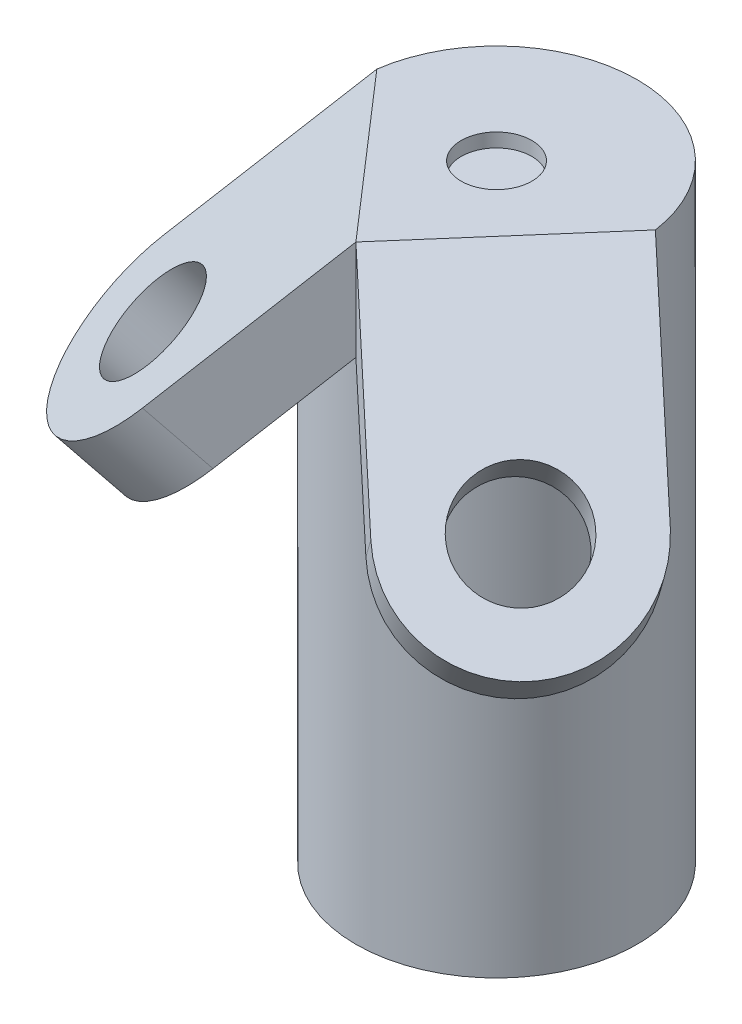
ISO-10303-21;
HEADER;
FILE_DESCRIPTION(('STEP AP214'),'2;1');
FILE_NAME('part.step','',(''),(''),'','','');
FILE_SCHEMA(('AUTOMOTIVE_DESIGN { 1 0 10303 214 1 1 1 1 }'));
ENDSEC;
DATA;
#1=APPLICATION_CONTEXT('core data for automotive mechanical design processes');
#2=APPLICATION_PROTOCOL_DEFINITION('international standard','automotive_design',2000,#1);
#3=PRODUCT_CONTEXT('',#1,'mechanical');
#4=PRODUCT('Part','Part','',(#3));
#5=PRODUCT_RELATED_PRODUCT_CATEGORY('part','',(#4));
#6=PRODUCT_DEFINITION_FORMATION('','',#4);
#7=PRODUCT_DEFINITION_CONTEXT('part definition',#1,'design');
#8=PRODUCT_DEFINITION('design','',#6,#7);
#9=PRODUCT_DEFINITION_SHAPE('','',#8);
#10=(LENGTH_UNIT() NAMED_UNIT(*) SI_UNIT(.MILLI.,.METRE.));
#11=(NAMED_UNIT(*) PLANE_ANGLE_UNIT() SI_UNIT($,.RADIAN.));
#12=(NAMED_UNIT(*) SI_UNIT($,.STERADIAN.) SOLID_ANGLE_UNIT());
#13=UNCERTAINTY_MEASURE_WITH_UNIT(LENGTH_MEASURE(1.E-05),#10,'distance_accuracy_value','');
#14=(GEOMETRIC_REPRESENTATION_CONTEXT(3) GLOBAL_UNCERTAINTY_ASSIGNED_CONTEXT((#13)) GLOBAL_UNIT_ASSIGNED_CONTEXT((#10,
#11,#12)) REPRESENTATION_CONTEXT('',''));
#15=CARTESIAN_POINT('',(0.,0.,0.));
#16=DIRECTION('',(0.,0.,1.));
#17=DIRECTION('',(1.,0.,0.));
#18=AXIS2_PLACEMENT_3D('',#15,#16,#17);
#19=CARTESIAN_POINT('',(0.,439.,0.));
#20=DIRECTION('',(0.,1.,0.));
#21=DIRECTION('',(0.,0.,1.));
#22=AXIS2_PLACEMENT_3D('',#19,#20,#21);
#23=PLANE('',#22);
#24=CARTESIAN_POINT('',(0.,439.,0.));
#25=DIRECTION('',(0.,1.,0.));
#26=DIRECTION('',(0.,0.,1.));
#27=AXIS2_PLACEMENT_3D('',#24,#25,#26);
#28=CIRCLE('',#27,25.5);
#29=CARTESIAN_POINT('',(0.,439.,25.5));
#30=VERTEX_POINT('',#29);
#31=EDGE_CURVE('E176',#30,#30,#28,.T.);
#32=ORIENTED_EDGE('',*,*,#31,.F.);
#33=EDGE_LOOP('',(#32));
#34=FACE_BOUND('',#33,.T.);
#35=CARTESIAN_POINT('',(0.,439.,0.));
#36=DIRECTION('',(0.,-1.,0.));
#37=DIRECTION('',(0.,0.,-1.));
#38=AXIS2_PLACEMENT_3D('',#35,#36,#37);
#39=CIRCLE('',#38,101.5);
#40=CARTESIAN_POINT('',(-100.51220897727,439.,-14.1260697474463));
#41=VERTEX_POINT('',#40);
#42=CARTESIAN_POINT('',(100.512208977269,439.,-14.1260697474464));
#43=VERTEX_POINT('',#42);
#44=EDGE_CURVE('E145',#41,#43,#39,.T.);
#45=ORIENTED_EDGE('',*,*,#44,.F.);
#46=DIRECTION('',(0.656059028990508,0.,0.754709580222771));
#47=VECTOR('',#46,1.);
#48=CARTESIAN_POINT('',(-1.38777878078145E-13,439.,101.5));
#49=LINE('',#48,#47);
#50=CARTESIAN_POINT('',(0.,439.,101.5));
#51=VERTEX_POINT('',#50);
#52=EDGE_CURVE('E118',#41,#51,#49,.T.);
#53=ORIENTED_EDGE('',*,*,#52,.T.);
#54=DIRECTION('',(-0.656059028990508,0.,0.754709580222771));
#55=VECTOR('',#54,1.);
#56=CARTESIAN_POINT('',(1.38777878078145E-13,439.,101.5));
#57=LINE('',#56,#55);
#58=EDGE_CURVE('E149',#43,#51,#57,.T.);
#59=ORIENTED_EDGE('',*,*,#58,.F.);
#60=EDGE_LOOP('',(#45,#53,#59));
#61=FACE_BOUND('',#60,.T.);
#62=ADVANCED_FACE('F37',(#34,#61),#23,.T.);
#63=CARTESIAN_POINT('',(0.,-167.269578169429,0.));
#64=DIRECTION('',(0.,-1.,0.));
#65=DIRECTION('',(0.,0.,-1.));
#66=AXIS2_PLACEMENT_3D('',#63,#64,#65);
#67=CYLINDRICAL_SURFACE('',#66,76.);
#68=CARTESIAN_POINT('',(0.,0.,0.));
#69=DIRECTION('',(0.,-1.,0.));
#70=DIRECTION('',(0.,0.,-1.));
#71=AXIS2_PLACEMENT_3D('',#68,#69,#70);
#72=CIRCLE('',#71,76.);
#73=CARTESIAN_POINT('',(0.,0.,-76.));
#74=VERTEX_POINT('',#73);
#75=EDGE_CURVE('E158',#74,#74,#72,.T.);
#76=ORIENTED_EDGE('',*,*,#75,.T.);
#77=EDGE_LOOP('',(#76));
#78=FACE_BOUND('',#77,.T.);
#79=CARTESIAN_POINT('',(0.,413.5,0.));
#80=DIRECTION('',(0.,-1.,0.));
#81=DIRECTION('',(0.,0.,-1.));
#82=AXIS2_PLACEMENT_3D('',#79,#80,#81);
#83=CIRCLE('',#82,76.);
#84=CARTESIAN_POINT('',(-72.9557767421566,413.5,-21.2944743994445));
#85=VERTEX_POINT('',#84);
#86=CARTESIAN_POINT('',(72.9557767421566,413.5,-21.2944743994444));
#87=VERTEX_POINT('',#86);
#88=EDGE_CURVE('E188',#85,#87,#83,.T.);
#89=ORIENTED_EDGE('',*,*,#88,.F.);
#90=CARTESIAN_POINT('',(0.,372.410008557464,0.));
#91=DIRECTION('',(-0.533660262001973,-0.707106781186549,0.463903788257849));
#92=DIRECTION('',(0.533660262001975,-0.707106781186546,-0.463903788257851));
#93=AXIS2_PLACEMENT_3D('',#90,#91,#92);
#94=ELLIPSE('',#93,107.480230740355,76.);
#95=CARTESIAN_POINT('',(-68.7007104622915,402.937554159486,-32.4994212560223));
#96=VERTEX_POINT('',#95);
#97=EDGE_CURVE('E51',#85,#96,#94,.T.);
#98=ORIENTED_EDGE('',*,*,#97,.T.);
#99=CARTESIAN_POINT('',(0.,433.465099761509,0.));
#100=DIRECTION('',(0.533660262001975,-0.707106781186546,-0.463903788257851));
#101=DIRECTION('',(-0.533660262001973,-0.707106781186549,0.46390378825785));
#102=AXIS2_PLACEMENT_3D('',#99,#100,#101);
#103=ELLIPSE('',#102,107.480230740355,76.);
#104=CARTESIAN_POINT('',(0.,383.60461355823,76.));
#105=VERTEX_POINT('',#104);
#106=EDGE_CURVE('E311',#105,#96,#103,.T.);
#107=ORIENTED_EDGE('',*,*,#106,.F.);
#108=CARTESIAN_POINT('',(0.,433.465099761509,0.));
#109=DIRECTION('',(-0.533660262001975,-0.707106781186546,-0.463903788257851));
#110=DIRECTION('',(0.533660262001973,-0.707106781186549,0.46390378825785));
#111=AXIS2_PLACEMENT_3D('',#108,#109,#110);
#112=ELLIPSE('',#111,107.480230740355,76.);
#113=CARTESIAN_POINT('',(68.7007104622915,402.937554159486,-32.4994212560223));
#114=VERTEX_POINT('',#113);
#115=EDGE_CURVE('E155',#114,#105,#112,.T.);
#116=ORIENTED_EDGE('',*,*,#115,.F.);
#117=CARTESIAN_POINT('',(0.,372.410008557464,0.));
#118=DIRECTION('',(-0.533660262001973,0.707106781186549,-0.463903788257849));
#119=DIRECTION('',(-0.533660262001975,-0.707106781186546,-0.463903788257851));
#120=AXIS2_PLACEMENT_3D('',#117,#118,#119);
#121=ELLIPSE('',#120,107.480230740355,76.);
#122=EDGE_CURVE('E177',#87,#114,#121,.T.);
#123=ORIENTED_EDGE('',*,*,#122,.F.);
#124=EDGE_LOOP('',(#89,#98,#107,#116,#123));
#125=FACE_BOUND('',#124,.T.);
#126=ADVANCED_FACE('F193',(#78,#125),#67,.F.);
#127=CARTESIAN_POINT('',(76.,413.5,0.));
#128=DIRECTION('',(0.,-1.,0.));
#129=DIRECTION('',(0.,0.,-1.));
#130=AXIS2_PLACEMENT_3D('',#127,#128,#129);
#131=PLANE('',#130);
#132=DIRECTION('',(0.656059028990508,0.,-0.754709580222771));
#133=VECTOR('',#132,1.);
#134=CARTESIAN_POINT('',(63.7224323564716,413.5,-10.6727267251609));
#135=LINE('',#134,#133);
#136=CARTESIAN_POINT('',(0.,413.5,62.6315462890016));
#137=VERTEX_POINT('',#136);
#138=EDGE_CURVE('E151',#137,#87,#135,.T.);
#139=ORIENTED_EDGE('',*,*,#138,.F.);
#140=DIRECTION('',(-0.656059028990508,0.,-0.754709580222771));
#141=VECTOR('',#140,1.);
#142=CARTESIAN_POINT('',(1.70041197056368,413.5,64.5876464991985));
#143=LINE('',#142,#141);
#144=EDGE_CURVE('E59',#137,#85,#143,.T.);
#145=ORIENTED_EDGE('',*,*,#144,.T.);
#146=ORIENTED_EDGE('',*,*,#88,.T.);
#147=EDGE_LOOP('',(#139,#145,#146));
#148=FACE_BOUND('',#147,.T.);
#149=ADVANCED_FACE('F216',(#148),#131,.T.);
#150=CARTESIAN_POINT('',(73.2955356151687,402.937554159486,-37.7851629485968));
#151=DIRECTION('',(-0.533660262001973,0.707106781186549,-0.463903788257849));
#152=DIRECTION('',(-0.798191990781298,-0.602403142299729,0.));
#153=AXIS2_PLACEMENT_3D('',#150,#151,#152);
#154=PLANE('',#153);
#155=DIRECTION('',(-0.656059028990508,0.,0.754709580222771));
#156=VECTOR('',#155,1.);
#157=CARTESIAN_POINT('',(73.2955356151687,402.937554159486,-37.7851629485968));
#158=LINE('',#157,#156);
#159=CARTESIAN_POINT('',(0.,402.937554159486,46.5317056134354));
#160=VERTEX_POINT('',#159);
#161=EDGE_CURVE('E322',#114,#160,#158,.T.);
#162=ORIENTED_EDGE('',*,*,#161,.T.);
#163=DIRECTION('',(0.,0.548544827658019,0.836121146754246));
#164=VECTOR('',#163,1.);
#165=CARTESIAN_POINT('',(0.,364.265628266388,-12.414096797978));
#166=LINE('',#165,#164);
#167=EDGE_CURVE('E303',#160,#137,#166,.T.);
#168=ORIENTED_EDGE('',*,*,#167,.T.);
#169=ORIENTED_EDGE('',*,*,#138,.T.);
#170=ORIENTED_EDGE('',*,*,#122,.T.);
#171=EDGE_LOOP('',(#162,#168,#169,#170));
#172=FACE_BOUND('',#171,.T.);
#173=ADVANCED_FACE('F208',(#172),#154,.T.);
#174=CARTESIAN_POINT('',(0.,-167.269578169429,0.));
#175=DIRECTION('',(0.,-1.,0.));
#176=DIRECTION('',(0.,0.,-1.));
#177=AXIS2_PLACEMENT_3D('',#174,#175,#176);
#178=CYLINDRICAL_SURFACE('',#177,101.5);
#179=CARTESIAN_POINT('',(0.,433.465099761509,0.));
#180=DIRECTION('',(0.533660262001975,-0.707106781186546,-0.463903788257851));
#181=DIRECTION('',(-0.533660262001973,-0.707106781186549,0.46390378825785));
#182=AXIS2_PLACEMENT_3D('',#179,#180,#181);
#183=ELLIPSE('',#182,143.542676580869,101.5);
#184=CARTESIAN_POINT('',(-100.512208977269,366.875108318972,-14.1260697474464));
#185=VERTEX_POINT('',#184);
#186=CARTESIAN_POINT('',(0.,366.875108318972,101.5));
#187=VERTEX_POINT('',#186);
#188=EDGE_CURVE('E148',#185,#187,#183,.F.);
#189=ORIENTED_EDGE('',*,*,#188,.F.);
#190=DIRECTION('',(0.,-1.,0.));
#191=VECTOR('',#190,1.);
#192=CARTESIAN_POINT('',(-100.512208977269,-167.269578169429,-14.1260697474463));
#193=LINE('',#192,#191);
#194=EDGE_CURVE('E11',#185,#41,#193,.F.);
#195=ORIENTED_EDGE('',*,*,#194,.T.);
#196=ORIENTED_EDGE('',*,*,#44,.T.);
#197=DIRECTION('',(0.,-1.,0.));
#198=VECTOR('',#197,1.);
#199=CARTESIAN_POINT('',(100.512208977269,-167.269578169429,-14.1260697474463));
#200=LINE('',#199,#198);
#201=CARTESIAN_POINT('',(100.512208977269,366.875108318972,-14.1260697474464));
#202=VERTEX_POINT('',#201);
#203=EDGE_CURVE('E44',#202,#43,#200,.F.);
#204=ORIENTED_EDGE('',*,*,#203,.F.);
#205=CARTESIAN_POINT('',(0.,433.465099761509,0.));
#206=DIRECTION('',(-0.533660262001975,-0.707106781186546,-0.463903788257851));
#207=DIRECTION('',(0.533660262001973,-0.707106781186549,0.46390378825785));
#208=AXIS2_PLACEMENT_3D('',#205,#206,#207);
#209=ELLIPSE('',#208,143.542676580869,101.5);
#210=EDGE_CURVE('E173',#187,#202,#209,.F.);
#211=ORIENTED_EDGE('',*,*,#210,.F.);
#212=EDGE_LOOP('',(#189,#195,#196,#204,#211));
#213=FACE_BOUND('',#212,.T.);
#214=CARTESIAN_POINT('',(0.,0.,0.));
#215=DIRECTION('',(0.,-1.,0.));
#216=DIRECTION('',(0.,0.,-1.));
#217=AXIS2_PLACEMENT_3D('',#214,#215,#216);
#218=CIRCLE('',#217,101.5);
#219=CARTESIAN_POINT('',(0.,0.,-101.5));
#220=VERTEX_POINT('',#219);
#221=EDGE_CURVE('E152',#220,#220,#218,.T.);
#222=ORIENTED_EDGE('',*,*,#221,.F.);
#223=EDGE_LOOP('',(#222));
#224=FACE_BOUND('',#223,.T.);
#225=ADVANCED_FACE('F142',(#213,#224),#178,.T.);
#226=CARTESIAN_POINT('',(101.5,0.,0.));
#227=DIRECTION('',(0.,-1.,0.));
#228=DIRECTION('',(0.,0.,-1.));
#229=AXIS2_PLACEMENT_3D('',#226,#227,#228);
#230=PLANE('',#229);
#231=ORIENTED_EDGE('',*,*,#221,.T.);
#232=EDGE_LOOP('',(#231));
#233=FACE_BOUND('',#232,.T.);
#234=ORIENTED_EDGE('',*,*,#75,.F.);
#235=EDGE_LOOP('',(#234));
#236=FACE_BOUND('',#235,.T.);
#237=ADVANCED_FACE('F195',(#233,#236),#230,.T.);
#238=CARTESIAN_POINT('',(0.,429.,0.));
#239=DIRECTION('',(0.,1.,0.));
#240=DIRECTION('',(0.,0.,1.));
#241=AXIS2_PLACEMENT_3D('',#238,#239,#240);
#242=CYLINDRICAL_SURFACE('',#241,25.5);
#243=CARTESIAN_POINT('',(0.,429.,0.));
#244=DIRECTION('',(0.,1.,0.));
#245=DIRECTION('',(0.,0.,1.));
#246=AXIS2_PLACEMENT_3D('',#243,#244,#245);
#247=CIRCLE('',#246,25.5);
#248=CARTESIAN_POINT('',(0.,429.,25.5));
#249=VERTEX_POINT('',#248);
#250=EDGE_CURVE('E180',#249,#249,#247,.T.);
#251=ORIENTED_EDGE('',*,*,#250,.F.);
#252=EDGE_LOOP('',(#251));
#253=FACE_BOUND('',#252,.T.);
#254=ORIENTED_EDGE('',*,*,#31,.T.);
#255=EDGE_LOOP('',(#254));
#256=FACE_BOUND('',#255,.T.);
#257=ADVANCED_FACE('F197',(#253,#256),#242,.F.);
#258=CARTESIAN_POINT('',(0.,429.,0.));
#259=DIRECTION('',(0.,1.,0.));
#260=DIRECTION('',(0.,0.,1.));
#261=AXIS2_PLACEMENT_3D('',#258,#259,#260);
#262=PLANE('',#261);
#263=ORIENTED_EDGE('',*,*,#250,.T.);
#264=EDGE_LOOP('',(#263));
#265=FACE_BOUND('',#264,.T.);
#266=ADVANCED_FACE('F204',(#265),#262,.T.);
#267=CARTESIAN_POINT('',(105.439624063277,293.756227863852,91.6572668385354));
#268=DIRECTION('',(-0.533660262001975,-0.707106781186546,-0.463903788257851));
#269=DIRECTION('',(0.798191990781296,-0.602403142299732,0.));
#270=AXIS2_PLACEMENT_3D('',#267,#268,#269);
#271=PLANE('',#270);
#272=DIRECTION('',(0.,-0.548544827658022,0.836121146754244));
#273=VECTOR('',#272,1.);
#274=CARTESIAN_POINT('',(0.,349.387901658829,128.154928729585));
#275=LINE('',#274,#273);
#276=EDGE_CURVE('E308',#160,#105,#275,.T.);
#277=ORIENTED_EDGE('',*,*,#276,.F.);
#278=ORIENTED_EDGE('',*,*,#161,.F.);
#279=ORIENTED_EDGE('',*,*,#115,.T.);
#280=EDGE_LOOP('',(#277,#278,#279));
#281=FACE_BOUND('',#280,.T.);
#282=ADVANCED_FACE('F226',(#281),#271,.T.);
#283=CARTESIAN_POINT('',(105.439624063277,293.756227863853,91.6572668385355));
#284=DIRECTION('',(0.533660262001975,0.707106781186546,0.463903788257851));
#285=DIRECTION('',(-0.798191990781296,0.602403142299732,0.));
#286=AXIS2_PLACEMENT_3D('',#283,#284,#285);
#287=CIRCLE('',#286,38.5);
#288=CARTESIAN_POINT('',(74.709232418197,316.948748842392,91.6572668385355));
#289=VERTEX_POINT('',#288);
#290=EDGE_CURVE('E315',#289,#289,#287,.T.);
#291=ORIENTED_EDGE('',*,*,#290,.T.);
#292=EDGE_LOOP('',(#291));
#293=FACE_BOUND('',#292,.T.);
#294=DIRECTION('',(0.533660262001973,-0.707106781186549,0.46390378825785));
#295=VECTOR('',#294,1.);
#296=CARTESIAN_POINT('',(-27.2166733621007,402.937554159486,77.8409067988496));
#297=LINE('',#296,#295);
#298=CARTESIAN_POINT('',(55.1835195746421,293.756227863852,149.470301712259));
#299=VERTEX_POINT('',#298);
#300=EDGE_CURVE('E325',#187,#299,#297,.T.);
#301=ORIENTED_EDGE('',*,*,#300,.F.);
#302=ORIENTED_EDGE('',*,*,#210,.T.);
#303=DIRECTION('',(-0.533660262001973,0.707106781186549,-0.46390378825785));
#304=VECTOR('',#303,1.);
#305=CARTESIAN_POINT('',(73.2955356151687,402.937554159486,-37.7851629485968));
#306=LINE('',#305,#304);
#307=CARTESIAN_POINT('',(155.695728551911,293.756227863852,33.8442319648123));
#308=VERTEX_POINT('',#307);
#309=EDGE_CURVE('E172',#308,#202,#306,.T.);
#310=ORIENTED_EDGE('',*,*,#309,.F.);
#311=CARTESIAN_POINT('',(105.439624063277,293.756227863852,91.6572668385354));
#312=DIRECTION('',(0.533660262001975,0.707106781186546,0.463903788257851));
#313=DIRECTION('',(0.798191990781296,-0.602403142299732,0.));
#314=AXIS2_PLACEMENT_3D('',#311,#312,#313);
#315=CIRCLE('',#314,76.6030223926112);
#316=EDGE_CURVE('E327',#299,#308,#315,.T.);
#317=ORIENTED_EDGE('',*,*,#316,.F.);
#318=EDGE_LOOP('',(#301,#302,#310,#317));
#319=FACE_BOUND('',#318,.T.);
#320=ADVANCED_FACE('F242',(#293,#319),#271,.T.);
#321=CARTESIAN_POINT('',(73.2955356151687,402.937554159486,-37.7851629485968));
#322=DIRECTION('',(0.656059028990509,0.,-0.754709580222771));
#323=DIRECTION('',(-0.754709580222771,0.,-0.656059028990509));
#324=AXIS2_PLACEMENT_3D('',#321,#322,#323);
#325=PLANE('',#324);
#326=ORIENTED_EDGE('',*,*,#309,.T.);
#327=ORIENTED_EDGE('',*,*,#203,.T.);
#328=DIRECTION('',(-0.533660262001973,0.707106781186549,-0.46390378825785));
#329=VECTOR('',#328,1.);
#330=CARTESIAN_POINT('',(100.512208977269,439.,-14.1260697474463));
#331=LINE('',#330,#329);
#332=CARTESIAN_POINT('',(182.912401914012,329.818673704366,57.5033251659627));
#333=VERTEX_POINT('',#332);
#334=EDGE_CURVE('E170',#333,#43,#331,.T.);
#335=ORIENTED_EDGE('',*,*,#334,.F.);
#336=DIRECTION('',(0.533660262001975,0.707106781186546,0.463903788257851));
#337=VECTOR('',#336,1.);
#338=CARTESIAN_POINT('',(155.695728551911,293.756227863852,33.8442319648123));
#339=LINE('',#338,#337);
#340=EDGE_CURVE('E183',#308,#333,#339,.T.);
#341=ORIENTED_EDGE('',*,*,#340,.F.);
#342=EDGE_LOOP('',(#326,#327,#335,#341));
#343=FACE_BOUND('',#342,.T.);
#344=ADVANCED_FACE('F169',(#343),#325,.T.);
#345=CARTESIAN_POINT('',(105.439624063277,293.756227863852,91.6572668385354));
#346=DIRECTION('',(0.533660262001975,0.707106781186546,0.463903788257851));
#347=DIRECTION('',(-0.798191990781296,0.602403142299732,0.));
#348=AXIS2_PLACEMENT_3D('',#345,#346,#347);
#349=CYLINDRICAL_SURFACE('',#348,76.6030223926112);
#350=CARTESIAN_POINT('',(132.656297425377,329.818673704366,115.316360039686));
#351=DIRECTION('',(0.533660262001975,0.707106781186546,0.463903788257851));
#352=DIRECTION('',(0.798191990781296,-0.602403142299732,0.));
#353=AXIS2_PLACEMENT_3D('',#350,#351,#352);
#354=CIRCLE('',#353,76.6030223926112);
#355=CARTESIAN_POINT('',(82.4001929367428,329.818673704366,173.129394913409));
#356=VERTEX_POINT('',#355);
#357=EDGE_CURVE('E334',#356,#333,#354,.T.);
#358=ORIENTED_EDGE('',*,*,#357,.F.);
#359=DIRECTION('',(0.533660262001975,0.707106781186546,0.463903788257851));
#360=VECTOR('',#359,1.);
#361=CARTESIAN_POINT('',(55.1835195746421,293.756227863852,149.470301712259));
#362=LINE('',#361,#360);
#363=EDGE_CURVE('E331',#299,#356,#362,.T.);
#364=ORIENTED_EDGE('',*,*,#363,.F.);
#365=ORIENTED_EDGE('',*,*,#316,.T.);
#366=ORIENTED_EDGE('',*,*,#340,.T.);
#367=EDGE_LOOP('',(#358,#364,#365,#366));
#368=FACE_BOUND('',#367,.T.);
#369=ADVANCED_FACE('F235',(#368),#349,.T.);
#370=CARTESIAN_POINT('',(-27.2166733621007,402.937554159486,77.8409067988496));
#371=DIRECTION('',(-0.656059028990509,0.,0.754709580222771));
#372=DIRECTION('',(0.754709580222771,0.,0.656059028990509));
#373=AXIS2_PLACEMENT_3D('',#370,#371,#372);
#374=PLANE('',#373);
#375=DIRECTION('',(0.533660262001973,-0.707106781186549,0.46390378825785));
#376=VECTOR('',#375,1.);
#377=CARTESIAN_POINT('',(0.,439.,101.5));
#378=LINE('',#377,#376);
#379=EDGE_CURVE('E321',#51,#356,#378,.T.);
#380=ORIENTED_EDGE('',*,*,#379,.F.);
#381=DIRECTION('',(0.,-1.,0.));
#382=VECTOR('',#381,1.);
#383=CARTESIAN_POINT('',(0.,-167.269578169429,101.5));
#384=LINE('',#383,#382);
#385=EDGE_CURVE('E163',#51,#187,#384,.T.);
#386=ORIENTED_EDGE('',*,*,#385,.T.);
#387=ORIENTED_EDGE('',*,*,#300,.T.);
#388=ORIENTED_EDGE('',*,*,#363,.T.);
#389=EDGE_LOOP('',(#380,#386,#387,#388));
#390=FACE_BOUND('',#389,.T.);
#391=ADVANCED_FACE('F231',(#390),#374,.T.);
#392=CARTESIAN_POINT('',(132.656297425377,329.818673704366,115.316360039686));
#393=DIRECTION('',(-0.533660262001975,-0.707106781186546,-0.463903788257851));
#394=DIRECTION('',(0.798191990781296,-0.602403142299732,0.));
#395=AXIS2_PLACEMENT_3D('',#392,#393,#394);
#396=PLANE('',#395);
#397=CARTESIAN_POINT('',(132.656297425378,329.818673704366,115.316360039686));
#398=DIRECTION('',(0.533660262001975,0.707106781186546,0.463903788257851));
#399=DIRECTION('',(-0.798191990781296,0.602403142299732,0.));
#400=AXIS2_PLACEMENT_3D('',#397,#398,#399);
#401=CIRCLE('',#400,38.5);
#402=CARTESIAN_POINT('',(101.925905780298,353.011194682906,115.316360039686));
#403=VERTEX_POINT('',#402);
#404=EDGE_CURVE('E314',#403,#403,#401,.T.);
#405=ORIENTED_EDGE('',*,*,#404,.F.);
#406=EDGE_LOOP('',(#405));
#407=FACE_BOUND('',#406,.T.);
#408=ORIENTED_EDGE('',*,*,#334,.T.);
#409=ORIENTED_EDGE('',*,*,#58,.T.);
#410=ORIENTED_EDGE('',*,*,#379,.T.);
#411=ORIENTED_EDGE('',*,*,#357,.T.);
#412=EDGE_LOOP('',(#408,#409,#410,#411));
#413=FACE_BOUND('',#412,.T.);
#414=ADVANCED_FACE('F234',(#407,#413),#396,.F.);
#415=CARTESIAN_POINT('',(105.439624063277,293.756227863853,91.6572668385355));
#416=DIRECTION('',(0.533660262001975,0.707106781186546,0.463903788257851));
#417=DIRECTION('',(-0.798191990781296,0.602403142299732,0.));
#418=AXIS2_PLACEMENT_3D('',#415,#416,#417);
#419=CYLINDRICAL_SURFACE('',#418,38.5);
#420=ORIENTED_EDGE('',*,*,#290,.F.);
#421=EDGE_LOOP('',(#420));
#422=FACE_BOUND('',#421,.T.);
#423=ORIENTED_EDGE('',*,*,#404,.T.);
#424=EDGE_LOOP('',(#423));
#425=FACE_BOUND('',#424,.T.);
#426=ADVANCED_FACE('F245',(#422,#425),#419,.F.);
#427=CARTESIAN_POINT('',(-132.656297425377,329.818673704366,115.316360039686));
#428=DIRECTION('',(0.533660262001975,-0.707106781186546,-0.463903788257851));
#429=DIRECTION('',(-0.798191990781296,-0.602403142299732,0.));
#430=AXIS2_PLACEMENT_3D('',#427,#428,#429);
#431=PLANE('',#430);
#432=CARTESIAN_POINT('',(-132.656297425378,329.818673704366,115.316360039686));
#433=DIRECTION('',(0.533660262001975,-0.707106781186546,-0.463903788257851));
#434=DIRECTION('',(0.798191990781296,0.602403142299732,0.));
#435=AXIS2_PLACEMENT_3D('',#432,#433,#434);
#436=CIRCLE('',#435,38.5);
#437=CARTESIAN_POINT('',(-101.925905780298,353.011194682906,115.316360039686));
#438=VERTEX_POINT('',#437);
#439=EDGE_CURVE('E285',#438,#438,#436,.T.);
#440=ORIENTED_EDGE('',*,*,#439,.T.);
#441=EDGE_LOOP('',(#440));
#442=FACE_BOUND('',#441,.T.);
#443=DIRECTION('',(-0.533660262001973,-0.707106781186549,0.46390378825785));
#444=VECTOR('',#443,1.);
#445=CARTESIAN_POINT('',(0.,439.,101.5));
#446=LINE('',#445,#444);
#447=CARTESIAN_POINT('',(-82.4001929367428,329.818673704366,173.129394913409));
#448=VERTEX_POINT('',#447);
#449=EDGE_CURVE('E123',#51,#448,#446,.T.);
#450=ORIENTED_EDGE('',*,*,#449,.F.);
#451=ORIENTED_EDGE('',*,*,#52,.F.);
#452=DIRECTION('',(0.533660262001973,0.707106781186549,-0.46390378825785));
#453=VECTOR('',#452,1.);
#454=CARTESIAN_POINT('',(-100.512208977269,439.,-14.1260697474463));
#455=LINE('',#454,#453);
#456=CARTESIAN_POINT('',(-182.912401914012,329.818673704366,57.5033251659627));
#457=VERTEX_POINT('',#456);
#458=EDGE_CURVE('E122',#457,#41,#455,.T.);
#459=ORIENTED_EDGE('',*,*,#458,.F.);
#460=CARTESIAN_POINT('',(-132.656297425377,329.818673704366,115.316360039686));
#461=DIRECTION('',(0.533660262001975,-0.707106781186546,-0.463903788257851));
#462=DIRECTION('',(-0.798191990781296,-0.602403142299732,0.));
#463=AXIS2_PLACEMENT_3D('',#460,#461,#462);
#464=CIRCLE('',#463,76.6030223926112);
#465=EDGE_CURVE('E138',#448,#457,#464,.T.);
#466=ORIENTED_EDGE('',*,*,#465,.F.);
#467=EDGE_LOOP('',(#450,#451,#459,#466));
#468=FACE_BOUND('',#467,.T.);
#469=ADVANCED_FACE('F120',(#442,#468),#431,.F.);
#470=CARTESIAN_POINT('',(-73.2955356151687,402.937554159486,-37.7851629485968));
#471=DIRECTION('',(0.656059028990509,0.,0.754709580222771));
#472=DIRECTION('',(0.754709580222771,0.,-0.656059028990509));
#473=AXIS2_PLACEMENT_3D('',#470,#471,#472);
#474=PLANE('',#473);
#475=ORIENTED_EDGE('',*,*,#194,.F.);
#476=DIRECTION('',(0.533660262001973,0.707106781186549,-0.46390378825785));
#477=VECTOR('',#476,1.);
#478=CARTESIAN_POINT('',(-73.2955356151687,402.937554159486,-37.7851629485968));
#479=LINE('',#478,#477);
#480=CARTESIAN_POINT('',(-155.695728551911,293.756227863852,33.8442319648123));
#481=VERTEX_POINT('',#480);
#482=EDGE_CURVE('E292',#481,#185,#479,.T.);
#483=ORIENTED_EDGE('',*,*,#482,.F.);
#484=DIRECTION('',(-0.533660262001975,0.707106781186546,0.463903788257851));
#485=VECTOR('',#484,1.);
#486=CARTESIAN_POINT('',(-155.695728551911,293.756227863852,33.8442319648123));
#487=LINE('',#486,#485);
#488=EDGE_CURVE('E137',#481,#457,#487,.T.);
#489=ORIENTED_EDGE('',*,*,#488,.T.);
#490=ORIENTED_EDGE('',*,*,#458,.T.);
#491=EDGE_LOOP('',(#475,#483,#489,#490));
#492=FACE_BOUND('',#491,.T.);
#493=ADVANCED_FACE('F133',(#492),#474,.F.);
#494=CARTESIAN_POINT('',(-105.439624063277,293.756227863852,91.6572668385354));
#495=DIRECTION('',(-0.533660262001975,0.707106781186546,0.463903788257851));
#496=DIRECTION('',(-0.798191990781296,-0.602403142299732,0.));
#497=AXIS2_PLACEMENT_3D('',#494,#495,#496);
#498=CYLINDRICAL_SURFACE('',#497,76.6030223926112);
#499=ORIENTED_EDGE('',*,*,#465,.T.);
#500=ORIENTED_EDGE('',*,*,#488,.F.);
#501=CARTESIAN_POINT('',(-105.439624063277,293.756227863852,91.6572668385354));
#502=DIRECTION('',(0.533660262001975,-0.707106781186546,-0.463903788257851));
#503=DIRECTION('',(-0.798191990781296,-0.602403142299732,0.));
#504=AXIS2_PLACEMENT_3D('',#501,#502,#503);
#505=CIRCLE('',#504,76.6030223926112);
#506=CARTESIAN_POINT('',(-55.1835195746421,293.756227863852,149.470301712259));
#507=VERTEX_POINT('',#506);
#508=EDGE_CURVE('E294',#507,#481,#505,.T.);
#509=ORIENTED_EDGE('',*,*,#508,.F.);
#510=DIRECTION('',(-0.533660262001975,0.707106781186546,0.463903788257851));
#511=VECTOR('',#510,1.);
#512=CARTESIAN_POINT('',(-55.1835195746421,293.756227863852,149.470301712259));
#513=LINE('',#512,#511);
#514=EDGE_CURVE('E300',#507,#448,#513,.T.);
#515=ORIENTED_EDGE('',*,*,#514,.T.);
#516=EDGE_LOOP('',(#499,#500,#509,#515));
#517=FACE_BOUND('',#516,.T.);
#518=ADVANCED_FACE('F261',(#517),#498,.T.);
#519=CARTESIAN_POINT('',(27.2166733621007,402.937554159486,77.8409067988496));
#520=DIRECTION('',(-0.656059028990509,0.,-0.754709580222771));
#521=DIRECTION('',(-0.754709580222771,0.,0.656059028990509));
#522=AXIS2_PLACEMENT_3D('',#519,#520,#521);
#523=PLANE('',#522);
#524=ORIENTED_EDGE('',*,*,#385,.F.);
#525=ORIENTED_EDGE('',*,*,#449,.T.);
#526=ORIENTED_EDGE('',*,*,#514,.F.);
#527=DIRECTION('',(-0.533660262001973,-0.707106781186549,0.46390378825785));
#528=VECTOR('',#527,1.);
#529=CARTESIAN_POINT('',(27.2166733621007,402.937554159486,77.8409067988496));
#530=LINE('',#529,#528);
#531=EDGE_CURVE('E296',#187,#507,#530,.T.);
#532=ORIENTED_EDGE('',*,*,#531,.F.);
#533=EDGE_LOOP('',(#524,#525,#526,#532));
#534=FACE_BOUND('',#533,.T.);
#535=ADVANCED_FACE('F264',(#534),#523,.F.);
#536=CARTESIAN_POINT('',(-105.439624063277,293.756227863852,91.6572668385354));
#537=DIRECTION('',(0.533660262001975,-0.707106781186546,-0.463903788257851));
#538=DIRECTION('',(-0.798191990781296,-0.602403142299732,0.));
#539=AXIS2_PLACEMENT_3D('',#536,#537,#538);
#540=PLANE('',#539);
#541=CARTESIAN_POINT('',(-105.439624063277,293.756227863853,91.6572668385355));
#542=DIRECTION('',(0.533660262001975,-0.707106781186546,-0.463903788257851));
#543=DIRECTION('',(0.798191990781296,0.602403142299732,0.));
#544=AXIS2_PLACEMENT_3D('',#541,#542,#543);
#545=CIRCLE('',#544,38.5);
#546=CARTESIAN_POINT('',(-74.709232418197,316.948748842392,91.6572668385355));
#547=VERTEX_POINT('',#546);
#548=EDGE_CURVE('E129',#547,#547,#545,.T.);
#549=ORIENTED_EDGE('',*,*,#548,.F.);
#550=EDGE_LOOP('',(#549));
#551=FACE_BOUND('',#550,.T.);
#552=ORIENTED_EDGE('',*,*,#482,.T.);
#553=ORIENTED_EDGE('',*,*,#188,.T.);
#554=ORIENTED_EDGE('',*,*,#531,.T.);
#555=ORIENTED_EDGE('',*,*,#508,.T.);
#556=EDGE_LOOP('',(#552,#553,#554,#555));
#557=FACE_BOUND('',#556,.T.);
#558=ADVANCED_FACE('F257',(#551,#557),#540,.T.);
#559=CARTESIAN_POINT('',(-73.2955356151687,402.937554159486,-37.7851629485968));
#560=DIRECTION('',(-0.533660262001973,-0.707106781186549,0.463903788257849));
#561=DIRECTION('',(0.798191990781298,-0.602403142299729,0.));
#562=AXIS2_PLACEMENT_3D('',#559,#560,#561);
#563=PLANE('',#562);
#564=ORIENTED_EDGE('',*,*,#97,.F.);
#565=ORIENTED_EDGE('',*,*,#144,.F.);
#566=ORIENTED_EDGE('',*,*,#167,.F.);
#567=DIRECTION('',(0.656059028990508,0.,0.754709580222771));
#568=VECTOR('',#567,1.);
#569=CARTESIAN_POINT('',(-73.2955356151687,402.937554159486,-37.7851629485968));
#570=LINE('',#569,#568);
#571=EDGE_CURVE('E289',#96,#160,#570,.T.);
#572=ORIENTED_EDGE('',*,*,#571,.F.);
#573=EDGE_LOOP('',(#564,#565,#566,#572));
#574=FACE_BOUND('',#573,.T.);
#575=ADVANCED_FACE('F253',(#574),#563,.F.);
#576=ORIENTED_EDGE('',*,*,#276,.T.);
#577=ORIENTED_EDGE('',*,*,#106,.T.);
#578=ORIENTED_EDGE('',*,*,#571,.T.);
#579=EDGE_LOOP('',(#576,#577,#578));
#580=FACE_BOUND('',#579,.T.);
#581=ADVANCED_FACE('F256',(#580),#540,.T.);
#582=CARTESIAN_POINT('',(-105.439624063277,293.756227863853,91.6572668385355));
#583=DIRECTION('',(-0.533660262001975,0.707106781186546,0.463903788257851));
#584=DIRECTION('',(-0.798191990781296,-0.602403142299732,0.));
#585=AXIS2_PLACEMENT_3D('',#582,#583,#584);
#586=CYLINDRICAL_SURFACE('',#585,38.5);
#587=ORIENTED_EDGE('',*,*,#548,.T.);
#588=EDGE_LOOP('',(#587));
#589=FACE_BOUND('',#588,.T.);
#590=ORIENTED_EDGE('',*,*,#439,.F.);
#591=EDGE_LOOP('',(#590));
#592=FACE_BOUND('',#591,.T.);
#593=ADVANCED_FACE('F274',(#589,#592),#586,.F.);
#594=CLOSED_SHELL('',(#62,#126,#149,#173,#225,#237,#257,#266,#282,#320,#344,#369,#391,#414,#426,
#469,#493,#518,#535,#558,#575,#581,#593));
#595=MANIFOLD_SOLID_BREP('B2',#594);
#596=ADVANCED_BREP_SHAPE_REPRESENTATION('',(#18,#595),#14);
#597=SHAPE_DEFINITION_REPRESENTATION(#9,#596);
ENDSEC;
END-ISO-10303-21;
